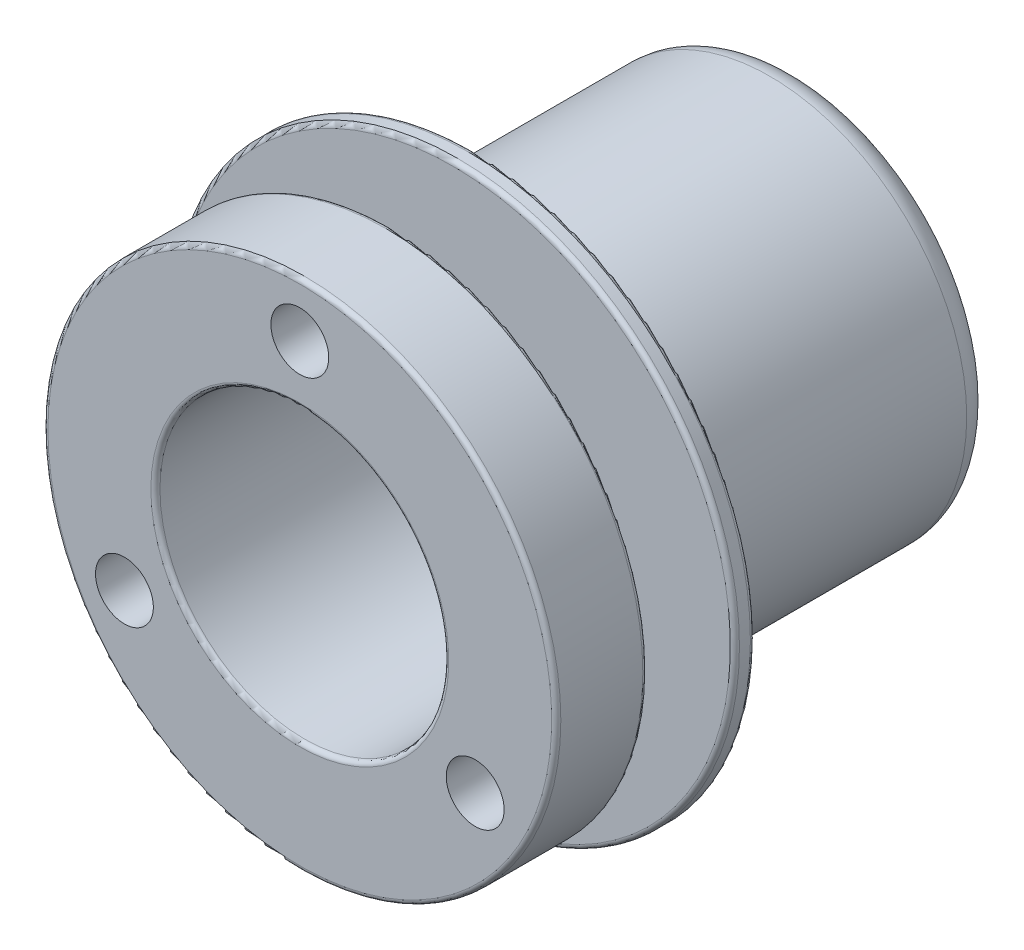
ISO-10303-21;
HEADER;
FILE_DESCRIPTION(('STEP AP214'),'2;1');
FILE_NAME('part.step','',(''),(''),'','','');
FILE_SCHEMA(('AUTOMOTIVE_DESIGN { 1 0 10303 214 1 1 1 1 }'));
ENDSEC;
DATA;
#1=APPLICATION_CONTEXT('core data for automotive mechanical design processes');
#2=APPLICATION_PROTOCOL_DEFINITION('international standard','automotive_design',2000,#1);
#3=PRODUCT_CONTEXT('',#1,'mechanical');
#4=PRODUCT('Part','Part','',(#3));
#5=PRODUCT_RELATED_PRODUCT_CATEGORY('part','',(#4));
#6=PRODUCT_DEFINITION_FORMATION('','',#4);
#7=PRODUCT_DEFINITION_CONTEXT('part definition',#1,'design');
#8=PRODUCT_DEFINITION('design','',#6,#7);
#9=PRODUCT_DEFINITION_SHAPE('','',#8);
#10=(LENGTH_UNIT() NAMED_UNIT(*) SI_UNIT(.MILLI.,.METRE.));
#11=(NAMED_UNIT(*) PLANE_ANGLE_UNIT() SI_UNIT($,.RADIAN.));
#12=(NAMED_UNIT(*) SI_UNIT($,.STERADIAN.) SOLID_ANGLE_UNIT());
#13=UNCERTAINTY_MEASURE_WITH_UNIT(LENGTH_MEASURE(1.E-05),#10,'distance_accuracy_value','');
#14=(GEOMETRIC_REPRESENTATION_CONTEXT(3) GLOBAL_UNCERTAINTY_ASSIGNED_CONTEXT((#13)) GLOBAL_UNIT_ASSIGNED_CONTEXT((#10,
#11,#12)) REPRESENTATION_CONTEXT('',''));
#15=CARTESIAN_POINT('',(0.,0.,0.));
#16=DIRECTION('',(0.,0.,1.));
#17=DIRECTION('',(1.,0.,0.));
#18=AXIS2_PLACEMENT_3D('',#15,#16,#17);
#19=CARTESIAN_POINT('',(1.11022302462516E-13,1.11022302462516E-13,-51.6000000000002));
#20=DIRECTION('',(0.,0.,1.));
#21=DIRECTION('',(1.,0.,0.));
#22=AXIS2_PLACEMENT_3D('',#19,#20,#21);
#23=TOROIDAL_SURFACE('',#22,18.6,3.);
#24=CARTESIAN_POINT('',(1.11022302462516E-13,1.11022302462516E-13,-51.6000000000002));
#25=DIRECTION('',(0.,0.,1.));
#26=DIRECTION('',(1.,0.,0.));
#27=AXIS2_PLACEMENT_3D('',#24,#25,#26);
#28=CIRCLE('',#27,21.6);
#29=CARTESIAN_POINT('',(21.6000000000001,1.11022302462516E-13,-51.6000000000002));
#30=VERTEX_POINT('',#29);
#31=EDGE_CURVE('E86',#30,#30,#28,.T.);
#32=ORIENTED_EDGE('',*,*,#31,.F.);
#33=EDGE_LOOP('',(#32));
#34=FACE_BOUND('',#33,.T.);
#35=CARTESIAN_POINT('',(1.11022302462516E-13,1.11022302462516E-13,-54.6000000000001));
#36=DIRECTION('',(0.,0.,1.));
#37=DIRECTION('',(1.,0.,0.));
#38=AXIS2_PLACEMENT_3D('',#35,#36,#37);
#39=CIRCLE('',#38,18.6);
#40=CARTESIAN_POINT('',(18.6000000000001,1.11022302462516E-13,-54.6000000000001));
#41=VERTEX_POINT('',#40);
#42=EDGE_CURVE('E71',#41,#41,#39,.T.);
#43=ORIENTED_EDGE('',*,*,#42,.T.);
#44=EDGE_LOOP('',(#43));
#45=FACE_BOUND('',#44,.T.);
#46=ADVANCED_FACE('F33',(#34,#45),#23,.T.);
#47=CARTESIAN_POINT('',(1.66533453693773E-13,18.6000000000001,-54.6000000000001));
#48=DIRECTION('',(0.,0.,1.));
#49=DIRECTION('',(1.,0.,0.));
#50=AXIS2_PLACEMENT_3D('',#47,#48,#49);
#51=PLANE('',#50);
#52=ORIENTED_EDGE('',*,*,#42,.F.);
#53=EDGE_LOOP('',(#52));
#54=FACE_BOUND('',#53,.T.);
#55=CARTESIAN_POINT('',(1.11022302462516E-13,1.11022302462516E-13,-54.6000000000001));
#56=DIRECTION('',(0.,0.,1.));
#57=DIRECTION('',(1.,0.,0.));
#58=AXIS2_PLACEMENT_3D('',#55,#56,#57);
#59=CIRCLE('',#58,15.85);
#60=CARTESIAN_POINT('',(15.8500000000001,1.11022302462516E-13,-54.6000000000001));
#61=VERTEX_POINT('',#60);
#62=EDGE_CURVE('E74',#61,#61,#59,.T.);
#63=ORIENTED_EDGE('',*,*,#62,.T.);
#64=EDGE_LOOP('',(#63));
#65=FACE_BOUND('',#64,.T.);
#66=ADVANCED_FACE('F141',(#54,#65),#51,.F.);
#67=CARTESIAN_POINT('',(1.11022302462516E-13,0.,9.86243265758457));
#68=DIRECTION('',(0.,0.,1.));
#69=DIRECTION('',(1.,0.,0.));
#70=AXIS2_PLACEMENT_3D('',#67,#68,#69);
#71=CYLINDRICAL_SURFACE('',#70,15.85);
#72=CARTESIAN_POINT('',(0.,0.,-0.500000000000056));
#73=DIRECTION('',(0.,0.,-1.));
#74=DIRECTION('',(-1.,0.,0.));
#75=AXIS2_PLACEMENT_3D('',#72,#73,#74);
#76=CIRCLE('',#75,15.85);
#77=CARTESIAN_POINT('',(-15.8499999999999,0.,-0.500000000000056));
#78=VERTEX_POINT('',#77);
#79=EDGE_CURVE('E44',#78,#78,#76,.F.);
#80=ORIENTED_EDGE('',*,*,#79,.T.);
#81=EDGE_LOOP('',(#80));
#82=FACE_BOUND('',#81,.T.);
#83=ORIENTED_EDGE('',*,*,#62,.F.);
#84=EDGE_LOOP('',(#83));
#85=FACE_BOUND('',#84,.T.);
#86=ADVANCED_FACE('F147',(#82,#85),#71,.F.);
#87=CARTESIAN_POINT('',(0.,15.85,0.));
#88=DIRECTION('',(0.,0.,-1.));
#89=DIRECTION('',(-1.,0.,0.));
#90=AXIS2_PLACEMENT_3D('',#87,#88,#89);
#91=PLANE('',#90);
#92=CARTESIAN_POINT('',(-19.2474145991075,-11.1125000000008,0.));
#93=DIRECTION('',(0.,0.,1.));
#94=DIRECTION('',(1.,0.,0.));
#95=AXIS2_PLACEMENT_3D('',#92,#93,#94);
#96=CIRCLE('',#95,3.175);
#97=CARTESIAN_POINT('',(-16.0724145991075,-11.1125000000008,0.));
#98=VERTEX_POINT('',#97);
#99=EDGE_CURVE('E102',#98,#98,#96,.T.);
#100=ORIENTED_EDGE('',*,*,#99,.F.);
#101=EDGE_LOOP('',(#100));
#102=FACE_BOUND('',#101,.T.);
#103=CARTESIAN_POINT('',(19.2474145991105,-11.1124999999992,-2.22044604925031E-13));
#104=DIRECTION('',(0.,0.,1.));
#105=DIRECTION('',(1.,0.,0.));
#106=AXIS2_PLACEMENT_3D('',#103,#104,#105);
#107=CIRCLE('',#106,3.175);
#108=CARTESIAN_POINT('',(22.4224145991105,-11.1124999999992,-2.22036055690412E-13));
#109=VERTEX_POINT('',#108);
#110=EDGE_CURVE('E96',#109,#109,#107,.T.);
#111=ORIENTED_EDGE('',*,*,#110,.F.);
#112=EDGE_LOOP('',(#111));
#113=FACE_BOUND('',#112,.T.);
#114=CARTESIAN_POINT('',(0.,22.225,-2.22044604925031E-13));
#115=DIRECTION('',(0.,0.,1.));
#116=DIRECTION('',(1.,0.,0.));
#117=AXIS2_PLACEMENT_3D('',#114,#115,#116);
#118=CIRCLE('',#117,3.175);
#119=CARTESIAN_POINT('',(3.175,22.225,-2.22036055690412E-13));
#120=VERTEX_POINT('',#119);
#121=EDGE_CURVE('E90',#120,#120,#118,.T.);
#122=ORIENTED_EDGE('',*,*,#121,.F.);
#123=EDGE_LOOP('',(#122));
#124=FACE_BOUND('',#123,.T.);
#125=CARTESIAN_POINT('',(0.,0.,0.));
#126=DIRECTION('',(0.,0.,-1.));
#127=DIRECTION('',(-1.,0.,0.));
#128=AXIS2_PLACEMENT_3D('',#125,#126,#127);
#129=CIRCLE('',#128,16.35);
#130=CARTESIAN_POINT('',(-16.35,0.,0.));
#131=VERTEX_POINT('',#130);
#132=EDGE_CURVE('E10',#131,#131,#129,.T.);
#133=ORIENTED_EDGE('',*,*,#132,.T.);
#134=EDGE_LOOP('',(#133));
#135=FACE_BOUND('',#134,.T.);
#136=CARTESIAN_POINT('',(0.,0.,0.));
#137=DIRECTION('',(0.,0.,-1.));
#138=DIRECTION('',(-1.,0.,0.));
#139=AXIS2_PLACEMENT_3D('',#136,#137,#138);
#140=CIRCLE('',#139,27.65);
#141=CARTESIAN_POINT('',(-27.65,0.,0.));
#142=VERTEX_POINT('',#141);
#143=EDGE_CURVE('E40',#142,#142,#140,.F.);
#144=ORIENTED_EDGE('',*,*,#143,.T.);
#145=EDGE_LOOP('',(#144));
#146=FACE_BOUND('',#145,.T.);
#147=ADVANCED_FACE('F179',(#102,#113,#124,#135,#146),#91,.F.);
#148=CARTESIAN_POINT('',(1.11022302462516E-13,0.,9.86243265758457));
#149=DIRECTION('',(0.,0.,1.));
#150=DIRECTION('',(1.,0.,0.));
#151=AXIS2_PLACEMENT_3D('',#148,#149,#150);
#152=CYLINDRICAL_SURFACE('',#151,28.15);
#153=CARTESIAN_POINT('',(0.,0.,-9.49999999999995));
#154=DIRECTION('',(0.,0.,1.));
#155=DIRECTION('',(1.,0.,0.));
#156=AXIS2_PLACEMENT_3D('',#153,#154,#155);
#157=CIRCLE('',#156,28.15);
#158=CARTESIAN_POINT('',(28.15,0.,-9.49999999999995));
#159=VERTEX_POINT('',#158);
#160=EDGE_CURVE('E65',#159,#159,#157,.T.);
#161=ORIENTED_EDGE('',*,*,#160,.T.);
#162=EDGE_LOOP('',(#161));
#163=FACE_BOUND('',#162,.T.);
#164=CARTESIAN_POINT('',(0.,0.,-0.500000000000056));
#165=DIRECTION('',(0.,0.,-1.));
#166=DIRECTION('',(-1.,0.,0.));
#167=AXIS2_PLACEMENT_3D('',#164,#165,#166);
#168=CIRCLE('',#167,28.15);
#169=CARTESIAN_POINT('',(-28.1499999999999,0.,-0.500000000000056));
#170=VERTEX_POINT('',#169);
#171=EDGE_CURVE('E68',#170,#170,#168,.T.);
#172=ORIENTED_EDGE('',*,*,#171,.T.);
#173=EDGE_LOOP('',(#172));
#174=FACE_BOUND('',#173,.T.);
#175=ADVANCED_FACE('F114',(#163,#174),#152,.T.);
#176=CARTESIAN_POINT('',(0.,28.1499999999999,-10.0000000000001));
#177=DIRECTION('',(0.,0.,1.));
#178=DIRECTION('',(1.,0.,0.));
#179=AXIS2_PLACEMENT_3D('',#176,#177,#178);
#180=PLANE('',#179);
#181=CARTESIAN_POINT('',(-19.2474145991076,-11.1125000000007,-10.0000000000002));
#182=DIRECTION('',(0.,0.,1.));
#183=DIRECTION('',(1.,0.,0.));
#184=AXIS2_PLACEMENT_3D('',#181,#182,#183);
#185=CIRCLE('',#184,3.175);
#186=CARTESIAN_POINT('',(-16.0724145991076,-11.1125000000007,-10.0000000000002));
#187=VERTEX_POINT('',#186);
#188=EDGE_CURVE('E99',#187,#187,#185,.F.);
#189=ORIENTED_EDGE('',*,*,#188,.F.);
#190=EDGE_LOOP('',(#189));
#191=FACE_BOUND('',#190,.T.);
#192=CARTESIAN_POINT('',(19.2474145991106,-11.1124999999992,-10.));
#193=DIRECTION('',(0.,0.,1.));
#194=DIRECTION('',(1.,0.,0.));
#195=AXIS2_PLACEMENT_3D('',#192,#193,#194);
#196=CIRCLE('',#195,3.175);
#197=CARTESIAN_POINT('',(22.4224145991106,-11.1124999999992,-10.));
#198=VERTEX_POINT('',#197);
#199=EDGE_CURVE('E93',#198,#198,#196,.F.);
#200=ORIENTED_EDGE('',*,*,#199,.F.);
#201=EDGE_LOOP('',(#200));
#202=FACE_BOUND('',#201,.T.);
#203=CARTESIAN_POINT('',(2.22044604925031E-13,22.2250000000001,-10.));
#204=DIRECTION('',(0.,0.,1.));
#205=DIRECTION('',(1.,0.,0.));
#206=AXIS2_PLACEMENT_3D('',#203,#204,#205);
#207=CIRCLE('',#206,3.175);
#208=CARTESIAN_POINT('',(3.17500000000022,22.2250000000001,-10.));
#209=VERTEX_POINT('',#208);
#210=EDGE_CURVE('E89',#209,#209,#207,.F.);
#211=ORIENTED_EDGE('',*,*,#210,.F.);
#212=EDGE_LOOP('',(#211));
#213=FACE_BOUND('',#212,.T.);
#214=CARTESIAN_POINT('',(0.,0.,-10.));
#215=DIRECTION('',(0.,0.,1.));
#216=DIRECTION('',(1.,0.,0.));
#217=AXIS2_PLACEMENT_3D('',#214,#215,#216);
#218=CIRCLE('',#217,27.65);
#219=CARTESIAN_POINT('',(27.6499999999999,0.,-10.));
#220=VERTEX_POINT('',#219);
#221=EDGE_CURVE('E62',#220,#220,#218,.F.);
#222=ORIENTED_EDGE('',*,*,#221,.T.);
#223=EDGE_LOOP('',(#222));
#224=FACE_BOUND('',#223,.T.);
#225=CARTESIAN_POINT('',(0.,0.,-10.));
#226=DIRECTION('',(0.,0.,1.));
#227=DIRECTION('',(1.,0.,0.));
#228=AXIS2_PLACEMENT_3D('',#225,#226,#227);
#229=CIRCLE('',#228,17.35);
#230=CARTESIAN_POINT('',(17.3499999999999,0.,-10.));
#231=VERTEX_POINT('',#230);
#232=EDGE_CURVE('E77',#231,#231,#229,.T.);
#233=ORIENTED_EDGE('',*,*,#232,.T.);
#234=EDGE_LOOP('',(#233));
#235=FACE_BOUND('',#234,.T.);
#236=ADVANCED_FACE('F110',(#191,#202,#213,#224,#235),#180,.F.);
#237=CARTESIAN_POINT('',(1.11022302462516E-13,0.,9.86243265758457));
#238=DIRECTION('',(0.,0.,1.));
#239=DIRECTION('',(1.,0.,0.));
#240=AXIS2_PLACEMENT_3D('',#237,#238,#239);
#241=CYLINDRICAL_SURFACE('',#240,17.35);
#242=ORIENTED_EDGE('',*,*,#232,.F.);
#243=EDGE_LOOP('',(#242));
#244=FACE_BOUND('',#243,.T.);
#245=CARTESIAN_POINT('',(0.,0.,-16.8045674127865));
#246=DIRECTION('',(0.,0.,1.));
#247=DIRECTION('',(1.,0.,0.));
#248=AXIS2_PLACEMENT_3D('',#245,#246,#247);
#249=CIRCLE('',#248,17.35);
#250=CARTESIAN_POINT('',(17.3500000000001,0.,-16.8045674127865));
#251=VERTEX_POINT('',#250);
#252=EDGE_CURVE('E80',#251,#251,#249,.T.);
#253=ORIENTED_EDGE('',*,*,#252,.T.);
#254=EDGE_LOOP('',(#253));
#255=FACE_BOUND('',#254,.T.);
#256=ADVANCED_FACE('F113',(#244,#255),#241,.T.);
#257=CARTESIAN_POINT('',(1.66533453693773E-13,17.35,-16.8045674127865));
#258=DIRECTION('',(0.,0.,-1.));
#259=DIRECTION('',(-1.,0.,0.));
#260=AXIS2_PLACEMENT_3D('',#257,#258,#259);
#261=PLANE('',#260);
#262=CARTESIAN_POINT('',(0.,0.,-16.8045674127865));
#263=DIRECTION('',(0.,0.,-1.));
#264=DIRECTION('',(-1.,0.,0.));
#265=AXIS2_PLACEMENT_3D('',#262,#263,#264);
#266=CIRCLE('',#265,30.45);
#267=CARTESIAN_POINT('',(-30.4499999999999,0.,-16.8045674127865));
#268=VERTEX_POINT('',#267);
#269=EDGE_CURVE('E48',#268,#268,#266,.F.);
#270=ORIENTED_EDGE('',*,*,#269,.T.);
#271=EDGE_LOOP('',(#270));
#272=FACE_BOUND('',#271,.T.);
#273=ORIENTED_EDGE('',*,*,#252,.F.);
#274=EDGE_LOOP('',(#273));
#275=FACE_BOUND('',#274,.T.);
#276=ADVANCED_FACE('F126',(#272,#275),#261,.F.);
#277=CARTESIAN_POINT('',(1.11022302462516E-13,0.,9.86243265758457));
#278=DIRECTION('',(0.,0.,1.));
#279=DIRECTION('',(1.,0.,0.));
#280=AXIS2_PLACEMENT_3D('',#277,#278,#279);
#281=CYLINDRICAL_SURFACE('',#280,30.95);
#282=CARTESIAN_POINT('',(1.11022302462516E-13,0.,-18.5045674127865));
#283=DIRECTION('',(0.,0.,1.));
#284=DIRECTION('',(1.,0.,0.));
#285=AXIS2_PLACEMENT_3D('',#282,#283,#284);
#286=CIRCLE('',#285,30.95);
#287=CARTESIAN_POINT('',(30.9500000000001,0.,-18.5045674127865));
#288=VERTEX_POINT('',#287);
#289=EDGE_CURVE('E56',#288,#288,#286,.T.);
#290=ORIENTED_EDGE('',*,*,#289,.T.);
#291=EDGE_LOOP('',(#290));
#292=FACE_BOUND('',#291,.T.);
#293=CARTESIAN_POINT('',(0.,0.,-17.3045674127864));
#294=DIRECTION('',(0.,0.,-1.));
#295=DIRECTION('',(-1.,0.,0.));
#296=AXIS2_PLACEMENT_3D('',#293,#294,#295);
#297=CIRCLE('',#296,30.95);
#298=CARTESIAN_POINT('',(-30.95,0.,-17.3045674127864));
#299=VERTEX_POINT('',#298);
#300=EDGE_CURVE('E59',#299,#299,#297,.T.);
#301=ORIENTED_EDGE('',*,*,#300,.T.);
#302=EDGE_LOOP('',(#301));
#303=FACE_BOUND('',#302,.T.);
#304=ADVANCED_FACE('F131',(#292,#303),#281,.T.);
#305=CARTESIAN_POINT('',(1.11022302462516E-13,30.9500000000001,-19.0045674127864));
#306=DIRECTION('',(0.,0.,1.));
#307=DIRECTION('',(1.,0.,0.));
#308=AXIS2_PLACEMENT_3D('',#305,#306,#307);
#309=PLANE('',#308);
#310=CARTESIAN_POINT('',(0.,0.,-19.0045674127866));
#311=DIRECTION('',(0.,0.,1.));
#312=DIRECTION('',(1.,0.,0.));
#313=AXIS2_PLACEMENT_3D('',#310,#311,#312);
#314=CIRCLE('',#313,30.45);
#315=CARTESIAN_POINT('',(30.45,0.,-19.0045674127866));
#316=VERTEX_POINT('',#315);
#317=EDGE_CURVE('E53',#316,#316,#314,.F.);
#318=ORIENTED_EDGE('',*,*,#317,.T.);
#319=EDGE_LOOP('',(#318));
#320=FACE_BOUND('',#319,.T.);
#321=CARTESIAN_POINT('',(0.,0.,-19.0045674127866));
#322=DIRECTION('',(0.,0.,1.));
#323=DIRECTION('',(1.,0.,0.));
#324=AXIS2_PLACEMENT_3D('',#321,#322,#323);
#325=CIRCLE('',#324,21.6);
#326=CARTESIAN_POINT('',(21.6,0.,-19.0045674127866));
#327=VERTEX_POINT('',#326);
#328=EDGE_CURVE('E83',#327,#327,#325,.T.);
#329=ORIENTED_EDGE('',*,*,#328,.T.);
#330=EDGE_LOOP('',(#329));
#331=FACE_BOUND('',#330,.T.);
#332=ADVANCED_FACE('F137',(#320,#331),#309,.F.);
#333=CARTESIAN_POINT('',(1.11022302462516E-13,0.,9.86243265758457));
#334=DIRECTION('',(0.,0.,1.));
#335=DIRECTION('',(1.,0.,0.));
#336=AXIS2_PLACEMENT_3D('',#333,#334,#335);
#337=CYLINDRICAL_SURFACE('',#336,21.6);
#338=ORIENTED_EDGE('',*,*,#328,.F.);
#339=EDGE_LOOP('',(#338));
#340=FACE_BOUND('',#339,.T.);
#341=ORIENTED_EDGE('',*,*,#31,.T.);
#342=EDGE_LOOP('',(#341));
#343=FACE_BOUND('',#342,.T.);
#344=ADVANCED_FACE('F158',(#340,#343),#337,.T.);
#345=CARTESIAN_POINT('',(0.,0.,-9.49999999999995));
#346=DIRECTION('',(0.,0.,1.));
#347=DIRECTION('',(1.,0.,0.));
#348=AXIS2_PLACEMENT_3D('',#345,#346,#347);
#349=TOROIDAL_SURFACE('',#348,27.65,0.5);
#350=ORIENTED_EDGE('',*,*,#221,.F.);
#351=EDGE_LOOP('',(#350));
#352=FACE_BOUND('',#351,.T.);
#353=ORIENTED_EDGE('',*,*,#160,.F.);
#354=EDGE_LOOP('',(#353));
#355=FACE_BOUND('',#354,.T.);
#356=ADVANCED_FACE('F154',(#352,#355),#349,.T.);
#357=CARTESIAN_POINT('',(1.11022302462516E-13,0.,-18.5045674127865));
#358=DIRECTION('',(0.,0.,1.));
#359=DIRECTION('',(1.,0.,0.));
#360=AXIS2_PLACEMENT_3D('',#357,#358,#359);
#361=TOROIDAL_SURFACE('',#360,30.45,0.5);
#362=ORIENTED_EDGE('',*,*,#317,.F.);
#363=EDGE_LOOP('',(#362));
#364=FACE_BOUND('',#363,.T.);
#365=ORIENTED_EDGE('',*,*,#289,.F.);
#366=EDGE_LOOP('',(#365));
#367=FACE_BOUND('',#366,.T.);
#368=ADVANCED_FACE('F157',(#364,#367),#361,.T.);
#369=CARTESIAN_POINT('',(0.,0.,-17.3045674127864));
#370=DIRECTION('',(0.,0.,-1.));
#371=DIRECTION('',(-1.,0.,0.));
#372=AXIS2_PLACEMENT_3D('',#369,#370,#371);
#373=TOROIDAL_SURFACE('',#372,30.45,0.5);
#374=ORIENTED_EDGE('',*,*,#300,.F.);
#375=EDGE_LOOP('',(#374));
#376=FACE_BOUND('',#375,.T.);
#377=ORIENTED_EDGE('',*,*,#269,.F.);
#378=EDGE_LOOP('',(#377));
#379=FACE_BOUND('',#378,.T.);
#380=ADVANCED_FACE('F162',(#376,#379),#373,.T.);
#381=CARTESIAN_POINT('',(0.,0.,-0.500000000000056));
#382=DIRECTION('',(0.,0.,-1.));
#383=DIRECTION('',(-1.,0.,0.));
#384=AXIS2_PLACEMENT_3D('',#381,#382,#383);
#385=TOROIDAL_SURFACE('',#384,16.35,0.5);
#386=ORIENTED_EDGE('',*,*,#132,.F.);
#387=EDGE_LOOP('',(#386));
#388=FACE_BOUND('',#387,.T.);
#389=ORIENTED_EDGE('',*,*,#79,.F.);
#390=EDGE_LOOP('',(#389));
#391=FACE_BOUND('',#390,.T.);
#392=ADVANCED_FACE('F165',(#388,#391),#385,.T.);
#393=CARTESIAN_POINT('',(0.,0.,-0.500000000000056));
#394=DIRECTION('',(0.,0.,-1.));
#395=DIRECTION('',(-1.,0.,0.));
#396=AXIS2_PLACEMENT_3D('',#393,#394,#395);
#397=TOROIDAL_SURFACE('',#396,27.65,0.5);
#398=ORIENTED_EDGE('',*,*,#171,.F.);
#399=EDGE_LOOP('',(#398));
#400=FACE_BOUND('',#399,.T.);
#401=ORIENTED_EDGE('',*,*,#143,.F.);
#402=EDGE_LOOP('',(#401));
#403=FACE_BOUND('',#402,.T.);
#404=ADVANCED_FACE('F35',(#400,#403),#397,.T.);
#405=CARTESIAN_POINT('',(2.22044604925031E-13,22.2250000000001,-54.601));
#406=DIRECTION('',(0.,0.,1.));
#407=DIRECTION('',(1.,0.,0.));
#408=AXIS2_PLACEMENT_3D('',#405,#406,#407);
#409=CYLINDRICAL_SURFACE('',#408,3.175);
#410=ORIENTED_EDGE('',*,*,#121,.T.);
#411=EDGE_LOOP('',(#410));
#412=FACE_BOUND('',#411,.T.);
#413=ORIENTED_EDGE('',*,*,#210,.T.);
#414=EDGE_LOOP('',(#413));
#415=FACE_BOUND('',#414,.T.);
#416=ADVANCED_FACE('F172',(#412,#415),#409,.F.);
#417=CARTESIAN_POINT('',(19.2474145991106,-11.1124999999992,-54.6010000000002));
#418=DIRECTION('',(0.,0.,1.));
#419=DIRECTION('',(1.,0.,0.));
#420=AXIS2_PLACEMENT_3D('',#417,#418,#419);
#421=CYLINDRICAL_SURFACE('',#420,3.175);
#422=ORIENTED_EDGE('',*,*,#110,.T.);
#423=EDGE_LOOP('',(#422));
#424=FACE_BOUND('',#423,.T.);
#425=ORIENTED_EDGE('',*,*,#199,.T.);
#426=EDGE_LOOP('',(#425));
#427=FACE_BOUND('',#426,.T.);
#428=ADVANCED_FACE('F272',(#424,#427),#421,.F.);
#429=CARTESIAN_POINT('',(-19.2474145991077,-11.1125000000009,-54.6010000000002));
#430=DIRECTION('',(0.,0.,1.));
#431=DIRECTION('',(1.,0.,0.));
#432=AXIS2_PLACEMENT_3D('',#429,#430,#431);
#433=CYLINDRICAL_SURFACE('',#432,3.175);
#434=ORIENTED_EDGE('',*,*,#99,.T.);
#435=EDGE_LOOP('',(#434));
#436=FACE_BOUND('',#435,.T.);
#437=ORIENTED_EDGE('',*,*,#188,.T.);
#438=EDGE_LOOP('',(#437));
#439=FACE_BOUND('',#438,.T.);
#440=ADVANCED_FACE('F108',(#436,#439),#433,.F.);
#441=CLOSED_SHELL('',(#46,#66,#86,#147,#175,#236,#256,#276,#304,#332,#344,#356,#368,#380,#392,
#404,#416,#428,#440));
#442=MANIFOLD_SOLID_BREP('B2',#441);
#443=ADVANCED_BREP_SHAPE_REPRESENTATION('',(#18,#442),#14);
#444=SHAPE_DEFINITION_REPRESENTATION(#9,#443);
ENDSEC;
END-ISO-10303-21;
